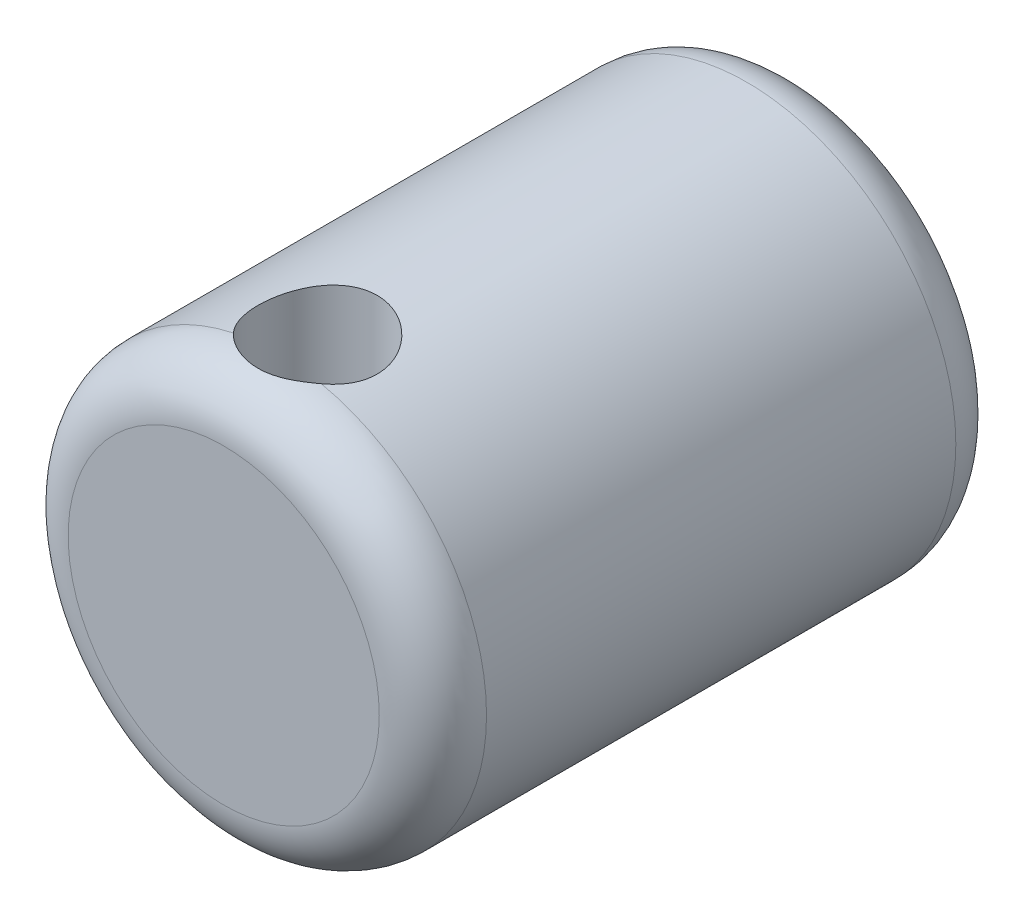
ISO-10303-21;
HEADER;
FILE_DESCRIPTION(('STEP AP214'),'2;1');
FILE_NAME('part.step','',(''),(''),'','','');
FILE_SCHEMA(('AUTOMOTIVE_DESIGN { 1 0 10303 214 1 1 1 1 }'));
ENDSEC;
DATA;
#1=APPLICATION_CONTEXT('core data for automotive mechanical design processes');
#2=APPLICATION_PROTOCOL_DEFINITION('international standard','automotive_design',2000,#1);
#3=PRODUCT_CONTEXT('',#1,'mechanical');
#4=PRODUCT('Part','Part','',(#3));
#5=PRODUCT_RELATED_PRODUCT_CATEGORY('part','',(#4));
#6=PRODUCT_DEFINITION_FORMATION('','',#4);
#7=PRODUCT_DEFINITION_CONTEXT('part definition',#1,'design');
#8=PRODUCT_DEFINITION('design','',#6,#7);
#9=PRODUCT_DEFINITION_SHAPE('','',#8);
#10=(LENGTH_UNIT() NAMED_UNIT(*) SI_UNIT(.MILLI.,.METRE.));
#11=(NAMED_UNIT(*) PLANE_ANGLE_UNIT() SI_UNIT($,.RADIAN.));
#12=(NAMED_UNIT(*) SI_UNIT($,.STERADIAN.) SOLID_ANGLE_UNIT());
#13=UNCERTAINTY_MEASURE_WITH_UNIT(LENGTH_MEASURE(1.E-05),#10,'distance_accuracy_value','');
#14=(GEOMETRIC_REPRESENTATION_CONTEXT(3) GLOBAL_UNCERTAINTY_ASSIGNED_CONTEXT((#13)) GLOBAL_UNIT_ASSIGNED_CONTEXT((#10,
#11,#12)) REPRESENTATION_CONTEXT('',''));
#15=CARTESIAN_POINT('',(0.,0.,0.));
#16=DIRECTION('',(0.,0.,1.));
#17=DIRECTION('',(1.,0.,0.));
#18=AXIS2_PLACEMENT_3D('',#15,#16,#17);
#19=CARTESIAN_POINT('',(0.,0.,-8.89));
#20=DIRECTION('',(0.,0.,1.));
#21=DIRECTION('',(1.,0.,0.));
#22=AXIS2_PLACEMENT_3D('',#19,#20,#21);
#23=CYLINDRICAL_SURFACE('',#22,4.953);
#24=CARTESIAN_POINT('',(0.,0.,-7.62));
#25=DIRECTION('',(0.,0.,1.));
#26=DIRECTION('',(1.,0.,0.));
#27=AXIS2_PLACEMENT_3D('',#24,#25,#26);
#28=CIRCLE('',#27,4.953);
#29=CARTESIAN_POINT('',(4.953,0.,-7.62));
#30=VERTEX_POINT('',#29);
#31=EDGE_CURVE('E74',#30,#30,#28,.T.);
#32=ORIENTED_EDGE('',*,*,#31,.T.);
#33=EDGE_LOOP('',(#32));
#34=FACE_BOUND('',#33,.T.);
#35=CARTESIAN_POINT('',(0.,4.953,1.12888888888889));
#36=CARTESIAN_POINT('',(-0.0775885930600474,4.95299906505589,1.12889027991103));
#37=CARTESIAN_POINT('',(-0.15519151039593,4.9511591936283,1.13530942963889));
#38=CARTESIAN_POINT('',(-0.308148744530289,4.94399880486775,1.16076275463922));
#39=CARTESIAN_POINT('',(-0.383502188746687,4.93867695474055,1.17980176044062));
#40=CARTESIAN_POINT('',(-0.529731464574674,4.92513773804115,1.22981576219991));
#41=CARTESIAN_POINT('',(-0.600613359971401,4.9169243966286,1.26077417109002));
#42=CARTESIAN_POINT('',(-0.736179805780747,4.89846250525702,1.33368317102475));
#43=CARTESIAN_POINT('',(-0.8008637169172,4.88821374569394,1.37563489428524));
#44=CARTESIAN_POINT('',(-0.923889815303389,4.86648069189639,1.47049698514802));
#45=CARTESIAN_POINT('',(-0.982046887053062,4.85497299330631,1.52364206090222));
#46=CARTESIAN_POINT('',(-1.08875533654719,4.83216353681871,1.63888136226149));
#47=CARTESIAN_POINT('',(-1.13730528338975,4.82086180982619,1.70097691858974));
#48=CARTESIAN_POINT('',(-1.22436177969705,4.79950022716315,1.83387929017143));
#49=CARTESIAN_POINT('',(-1.26264846706164,4.78946966943187,1.90483527101752));
#50=CARTESIAN_POINT('',(-1.32667278734697,4.77213330541619,2.0525099670057));
#51=CARTESIAN_POINT('',(-1.35241310265716,4.76482691678843,2.1292274462994));
#52=CARTESIAN_POINT('',(-1.38995793922755,4.75400899563397,2.28418152353182));
#53=CARTESIAN_POINT('',(-1.40210116622748,4.75040542339591,2.36232946370478));
#54=CARTESIAN_POINT('',(-1.41316404957219,4.74712676993972,2.51963004164591));
#55=CARTESIAN_POINT('',(-1.41208656115693,4.74745084047967,2.59878245879142));
#56=CARTESIAN_POINT('',(-1.39700596234428,4.75190890570848,2.75314349415476));
#57=CARTESIAN_POINT('',(-1.38342027979002,4.75591985369119,2.82839702492328));
#58=CARTESIAN_POINT('',(-1.34438062777659,4.76710163221604,2.97550937825752));
#59=CARTESIAN_POINT('',(-1.31892559085754,4.7742727469618,3.04736789485538));
#60=CARTESIAN_POINT('',(-1.25654730165592,4.79106966195446,3.18670255205945));
#61=CARTESIAN_POINT('',(-1.21948360129474,4.80072525061155,3.25411207230086));
#62=CARTESIAN_POINT('',(-1.13503784776128,4.82138806950275,3.38189789512862));
#63=CARTESIAN_POINT('',(-1.08765350900133,4.83239559889905,3.44227263525352));
#64=CARTESIAN_POINT('',(-0.98180980093079,4.85502723154635,3.55665101803811));
#65=CARTESIAN_POINT('',(-0.923002040701852,4.8666589849771,3.61033126045005));
#66=CARTESIAN_POINT('',(-0.797075056679853,4.88886103084431,3.70713897414022));
#67=CARTESIAN_POINT('',(-0.729955407277527,4.89943126887577,3.75026590470062));
#68=CARTESIAN_POINT('',(-0.588762896052575,4.91840037132882,3.8249135434887));
#69=CARTESIAN_POINT('',(-0.514653609426415,4.92678689518358,3.8563686996308));
#70=CARTESIAN_POINT('',(-0.361903721110916,4.94035469963584,3.90627654710075));
#71=CARTESIAN_POINT('',(-0.283264260173515,4.94553678332621,3.9247324964352));
#72=CARTESIAN_POINT('',(-0.126440532934422,4.95198738626627,3.94759397125816));
#73=CARTESIAN_POINT('',(-0.0483251816814675,4.95337811770122,3.95243841960913));
#74=CARTESIAN_POINT('',(0.107604399926596,4.95244451218538,3.94916117038316));
#75=CARTESIAN_POINT('',(0.185418665080456,4.95012061824891,3.9410410189928));
#76=CARTESIAN_POINT('',(0.33692258528249,4.94209843126923,3.91242255962229));
#77=CARTESIAN_POINT('',(0.4106636249542,4.93646861795894,3.89217529068468));
#78=CARTESIAN_POINT('',(0.553690614129379,4.92247944476343,3.84017445503558));
#79=CARTESIAN_POINT('',(0.622976048595792,4.91411977000156,3.80841956092738));
#80=CARTESIAN_POINT('',(0.756782487413098,4.89531979829011,3.73353237875509));
#81=CARTESIAN_POINT('',(0.821168553249705,4.88483852649799,3.69016954035576));
#82=CARTESIAN_POINT('',(0.941902009312916,4.86300319333712,3.59358191210086));
#83=CARTESIAN_POINT('',(0.998247576283992,4.85164893490614,3.54035489172317));
#84=CARTESIAN_POINT('',(1.1031954400924,4.82888702754697,3.42349269479839));
#85=CARTESIAN_POINT('',(1.15148646248705,4.81748964255587,3.35957541137898));
#86=CARTESIAN_POINT('',(1.23667199548381,4.79633036726393,3.22429873605404));
#87=CARTESIAN_POINT('',(1.27356690709098,4.78656841942104,3.15293960612958));
#88=CARTESIAN_POINT('',(1.33464325449896,4.76989932295884,3.00510410049));
#89=CARTESIAN_POINT('',(1.35889243247116,4.76297700618803,2.92865751776168));
#90=CARTESIAN_POINT('',(1.39411618721669,4.75278778548103,2.77253634417422));
#91=CARTESIAN_POINT('',(1.40509475776408,4.74951978180572,2.69286273194972));
#92=CARTESIAN_POINT('',(1.41321295834493,4.74711002986155,2.53576026032293));
#93=CARTESIAN_POINT('',(1.41085652980242,4.74781801747243,2.45835938411562));
#94=CARTESIAN_POINT('',(1.39355871888063,4.75292359256403,2.30510722965311));
#95=CARTESIAN_POINT('',(1.37861775197942,4.75732105823674,2.22925590032434));
#96=CARTESIAN_POINT('',(1.33688543699768,4.76921444005906,2.08199104745025));
#97=CARTESIAN_POINT('',(1.31021508985119,4.77667866888818,2.01054049038486));
#98=CARTESIAN_POINT('',(1.2458746797385,4.79386160284244,1.87307187916816));
#99=CARTESIAN_POINT('',(1.20820267928947,4.80358070500755,1.80705478452205));
#100=CARTESIAN_POINT('',(1.12146107686557,4.82458134910784,1.67995702897613));
#101=CARTESIAN_POINT('',(1.07205447747273,4.83590406369499,1.61911315075819));
#102=CARTESIAN_POINT('',(0.96386866501546,4.85862289512435,1.50641627379429));
#103=CARTESIAN_POINT('',(0.905087099014124,4.8700190297027,1.45456553899282));
#104=CARTESIAN_POINT('',(0.77801555747535,4.89194817868337,1.36001890899291));
#105=CARTESIAN_POINT('',(0.709521596793445,4.90245183006856,1.31758971337451));
#106=CARTESIAN_POINT('',(0.566073546488071,4.92107569573418,1.24491245951963));
#107=CARTESIAN_POINT('',(0.491123042391253,4.92919722198694,1.21465769270207));
#108=CARTESIAN_POINT('',(0.34720201834831,4.94127142551116,1.17048356039092));
#109=CARTESIAN_POINT('',(0.278765077144419,4.94563534566828,1.15492491582538));
#110=CARTESIAN_POINT('',(0.140222508980719,4.95149986626767,1.13412763310066));
#111=CARTESIAN_POINT('',(0.070117103668698,4.95300084491251,1.12888763181694));
#112=CARTESIAN_POINT('',(0.,4.953,1.12888888888889));
#113=B_SPLINE_CURVE_WITH_KNOTS('',3,(#35,#36,#37,#38,#39,#40,#41,#42,#43,#44,#45,#46,#47,#48,
#49,#50,#51,#52,#53,#54,#55,#56,#57,#58,#59,#60,#61,#62,#63,#64,#65,#66,#67,#68,#69,#70,#71,#72,
#73,#74,#75,#76,#77,#78,#79,#80,#81,#82,#83,#84,#85,#86,#87,#88,#89,#90,#91,#92,#93,#94,#95,#96,
#97,#98,#99,#100,#101,#102,#103,#104,#105,#106,#107,#108,#109,#110,#111,#112),.UNSPECIFIED.,.T.,
.F.,(4,2,2,2,2,2,2,2,2,2,2,2,2,2,2,2,2,2,2,2,2,2,2,2,2,2,2,2,2,2,2,2,2,2,2,2,2,2,4),(0.,
0.232508420439531,0.465105890050664,0.697380839655164,0.929679720969844,1.16744661902199,
1.40524890387857,1.64779878439725,1.89029678546198,2.12660953848822,2.36287125662615,
2.59152342694713,2.82019616486583,3.05174996398897,3.28335509478129,3.5236365361368,
3.76393028616531,4.005553871168,4.24711687619557,4.48079565145541,4.71444655975383,
4.94342025899023,5.17242037859805,5.40635807172676,5.64034872832408,5.88194619747596,
6.12353516435479,6.36381630875039,6.60402512279387,6.83521835903041,7.06640396273003,
7.2952586258833,7.5241536165788,7.76065102498224,7.99720788337997,8.23978762210709,
8.48223350636485,8.69238000417044,8.90249873911369),.UNSPECIFIED.);
#114=CARTESIAN_POINT('',(1.04114279419359,4.84233731601783,3.4925));
#115=VERTEX_POINT('',#114);
#116=CARTESIAN_POINT('',(-1.04114279419359,4.84233731601783,3.4925));
#117=VERTEX_POINT('',#116);
#118=EDGE_CURVE('E73',#115,#117,#113,.T.);
#119=ORIENTED_EDGE('',*,*,#118,.F.);
#120=CARTESIAN_POINT('',(0.,0.,3.4925));
#121=DIRECTION('',(0.,0.,1.));
#122=DIRECTION('',(1.,0.,0.));
#123=AXIS2_PLACEMENT_3D('',#120,#121,#122);
#124=CIRCLE('',#123,4.953);
#125=CARTESIAN_POINT('',(1.04114279419359,-4.84233731601783,3.4925));
#126=VERTEX_POINT('',#125);
#127=EDGE_CURVE('E69',#115,#126,#124,.F.);
#128=ORIENTED_EDGE('',*,*,#127,.T.);
#129=CARTESIAN_POINT('',(0.,-4.953,3.95111111111111));
#130=CARTESIAN_POINT('',(0.0775885930600474,-4.95299906505589,3.95110972008897));
#131=CARTESIAN_POINT('',(0.15519151039593,-4.9511591936283,3.94469057036112));
#132=CARTESIAN_POINT('',(0.308148744530289,-4.94399880486775,3.91923724536078));
#133=CARTESIAN_POINT('',(0.383502188746687,-4.93867695474055,3.90019823955938));
#134=CARTESIAN_POINT('',(0.529731464574674,-4.92513773804115,3.85018423780009));
#135=CARTESIAN_POINT('',(0.600613359971401,-4.9169243966286,3.81922582890998));
#136=CARTESIAN_POINT('',(0.736179805780748,-4.89846250525702,3.74631682897525));
#137=CARTESIAN_POINT('',(0.8008637169172,-4.88821374569394,3.70436510571476));
#138=CARTESIAN_POINT('',(0.923889815303389,-4.86648069189639,3.60950301485198));
#139=CARTESIAN_POINT('',(0.982046887053062,-4.85497299330631,3.55635793909778));
#140=CARTESIAN_POINT('',(1.08875533654719,-4.83216353681871,3.44111863773851));
#141=CARTESIAN_POINT('',(1.13730528338975,-4.82086180982619,3.37902308141026));
#142=CARTESIAN_POINT('',(1.22436177969705,-4.79950022716315,3.24612070982857));
#143=CARTESIAN_POINT('',(1.26264846706164,-4.78946966943187,3.17516472898248));
#144=CARTESIAN_POINT('',(1.32667278734697,-4.77213330541619,3.0274900329943));
#145=CARTESIAN_POINT('',(1.35241310265716,-4.76482691678843,2.95077255370061));
#146=CARTESIAN_POINT('',(1.38995793922755,-4.75400899563397,2.79581847646818));
#147=CARTESIAN_POINT('',(1.40210116622748,-4.75040542339591,2.71767053629522));
#148=CARTESIAN_POINT('',(1.41316404957219,-4.74712676993972,2.56036995835409));
#149=CARTESIAN_POINT('',(1.41208656115693,-4.74745084047967,2.48121754120858));
#150=CARTESIAN_POINT('',(1.39700596234428,-4.75190890570848,2.32685650584524));
#151=CARTESIAN_POINT('',(1.38342027979002,-4.75591985369119,2.25160297507672));
#152=CARTESIAN_POINT('',(1.34438062777659,-4.76710163221604,2.10449062174248));
#153=CARTESIAN_POINT('',(1.31892559085754,-4.7742727469618,2.03263210514463));
#154=CARTESIAN_POINT('',(1.25654730165592,-4.79106966195446,1.89329744794055));
#155=CARTESIAN_POINT('',(1.21948360129474,-4.80072525061155,1.82588792769914));
#156=CARTESIAN_POINT('',(1.13503784776128,-4.82138806950275,1.69810210487138));
#157=CARTESIAN_POINT('',(1.08765350900133,-4.83239559889905,1.63772736474648));
#158=CARTESIAN_POINT('',(0.98180980093079,-4.85502723154635,1.52334898196189));
#159=CARTESIAN_POINT('',(0.923002040701852,-4.8666589849771,1.46966873954995));
#160=CARTESIAN_POINT('',(0.797075056679853,-4.88886103084431,1.37286102585978));
#161=CARTESIAN_POINT('',(0.729955407277527,-4.89943126887577,1.32973409529938));
#162=CARTESIAN_POINT('',(0.588762896052575,-4.91840037132882,1.2550864565113));
#163=CARTESIAN_POINT('',(0.514653609426415,-4.92678689518358,1.2236313003692));
#164=CARTESIAN_POINT('',(0.361903721110915,-4.94035469963584,1.17372345289925));
#165=CARTESIAN_POINT('',(0.283264260173514,-4.94553678332621,1.1552675035648));
#166=CARTESIAN_POINT('',(0.126440532934421,-4.95198738626627,1.13240602874184));
#167=CARTESIAN_POINT('',(0.0483251816814667,-4.95337811770122,1.12756158039087));
#168=CARTESIAN_POINT('',(-0.107604399926597,-4.95244451218538,1.13083882961684));
#169=CARTESIAN_POINT('',(-0.185418665080456,-4.95012061824891,1.1389589810072));
#170=CARTESIAN_POINT('',(-0.33692258528249,-4.94209843126923,1.16757744037771));
#171=CARTESIAN_POINT('',(-0.4106636249542,-4.93646861795894,1.18782470931533));
#172=CARTESIAN_POINT('',(-0.553690614129379,-4.92247944476343,1.23982554496442));
#173=CARTESIAN_POINT('',(-0.622976048595793,-4.91411977000156,1.27158043907262));
#174=CARTESIAN_POINT('',(-0.756782487413098,-4.89531979829011,1.34646762124491));
#175=CARTESIAN_POINT('',(-0.821168553249706,-4.88483852649799,1.38983045964424));
#176=CARTESIAN_POINT('',(-0.941902009312917,-4.86300319333712,1.48641808789914));
#177=CARTESIAN_POINT('',(-0.998247576283993,-4.85164893490614,1.53964510827683));
#178=CARTESIAN_POINT('',(-1.1031954400924,-4.82888702754697,1.65650730520161));
#179=CARTESIAN_POINT('',(-1.15148646248705,-4.81748964255587,1.72042458862102));
#180=CARTESIAN_POINT('',(-1.23667199548381,-4.79633036726393,1.85570126394596));
#181=CARTESIAN_POINT('',(-1.27356690709098,-4.78656841942104,1.92706039387042));
#182=CARTESIAN_POINT('',(-1.33464325449896,-4.76989932295884,2.07489589951));
#183=CARTESIAN_POINT('',(-1.35889243247116,-4.76297700618803,2.15134248223833));
#184=CARTESIAN_POINT('',(-1.39411618721669,-4.75278778548103,2.30746365582578));
#185=CARTESIAN_POINT('',(-1.40509475776408,-4.74951978180572,2.38713726805028));
#186=CARTESIAN_POINT('',(-1.41321295834493,-4.74711002986155,2.54423973967708));
#187=CARTESIAN_POINT('',(-1.41085652980242,-4.74781801747243,2.62164061588438));
#188=CARTESIAN_POINT('',(-1.39355871888063,-4.75292359256403,2.7748927703469));
#189=CARTESIAN_POINT('',(-1.37861775197942,-4.75732105823674,2.85074409967566));
#190=CARTESIAN_POINT('',(-1.33688543699768,-4.76921444005906,2.99800895254975));
#191=CARTESIAN_POINT('',(-1.31021508985119,-4.77667866888818,3.06945950961514));
#192=CARTESIAN_POINT('',(-1.24587467973849,-4.79386160284244,3.20692812083184));
#193=CARTESIAN_POINT('',(-1.20820267928947,-4.80358070500755,3.27294521547795));
#194=CARTESIAN_POINT('',(-1.12146107686557,-4.82458134910784,3.40004297102387));
#195=CARTESIAN_POINT('',(-1.07205447747273,-4.83590406369499,3.46088684924181));
#196=CARTESIAN_POINT('',(-0.963868665015459,-4.85862289512435,3.57358372620571));
#197=CARTESIAN_POINT('',(-0.905087099014124,-4.8700190297027,3.62543446100718));
#198=CARTESIAN_POINT('',(-0.77801555747535,-4.89194817868337,3.71998109100709));
#199=CARTESIAN_POINT('',(-0.709521596793445,-4.90245183006856,3.76241028662549));
#200=CARTESIAN_POINT('',(-0.566073546488072,-4.92107569573418,3.83508754048037));
#201=CARTESIAN_POINT('',(-0.491123042391254,-4.92919722198694,3.86534230729793));
#202=CARTESIAN_POINT('',(-0.34720201834831,-4.94127142551116,3.90951643960908));
#203=CARTESIAN_POINT('',(-0.278765077144418,-4.94563534566828,3.92507508417463));
#204=CARTESIAN_POINT('',(-0.140222508980718,-4.95149986626767,3.94587236689934));
#205=CARTESIAN_POINT('',(-0.0701171036686975,-4.95300084491251,3.95111236818306));
#206=CARTESIAN_POINT('',(0.,-4.953,3.95111111111111));
#207=B_SPLINE_CURVE_WITH_KNOTS('',3,(#129,#130,#131,#132,#133,#134,#135,#136,#137,#138,#139,
#140,#141,#142,#143,#144,#145,#146,#147,#148,#149,#150,#151,#152,#153,#154,#155,#156,#157,#158,
#159,#160,#161,#162,#163,#164,#165,#166,#167,#168,#169,#170,#171,#172,#173,#174,#175,#176,#177,
#178,#179,#180,#181,#182,#183,#184,#185,#186,#187,#188,#189,#190,#191,#192,#193,#194,#195,#196,
#197,#198,#199,#200,#201,#202,#203,#204,#205,#206),.UNSPECIFIED.,.T.,.F.,(4,2,2,2,2,2,2,2,2,2,2,
2,2,2,2,2,2,2,2,2,2,2,2,2,2,2,2,2,2,2,2,2,2,2,2,2,2,2,4),(0.,0.23250842043953,0.465105890050664,
0.697380839655164,0.929679720969845,1.16744661902199,1.40524890387857,1.64779878439725,
1.89029678546198,2.12660953848823,2.36287125662615,2.59152342694713,2.82019616486583,
3.05174996398897,3.28335509478129,3.5236365361368,3.76393028616531,4.005553871168,
4.24711687619557,4.48079565145542,4.71444655975383,4.94342025899023,5.17242037859805,
5.40635807172676,5.64034872832408,5.88194619747596,6.12353516435479,6.36381630875039,
6.60402512279387,6.83521835903042,7.06640396273003,7.29525862588331,7.5241536165788,
7.76065102498224,7.99720788337997,8.23978762210709,8.48223350636484,8.69238000417044,
8.90249873911369),.UNSPECIFIED.);
#208=CARTESIAN_POINT('',(-1.04114279419359,-4.84233731601783,3.4925));
#209=VERTEX_POINT('',#208);
#210=EDGE_CURVE('E72',#126,#209,#207,.T.);
#211=ORIENTED_EDGE('',*,*,#210,.T.);
#212=CARTESIAN_POINT('',(0.,0.,3.4925));
#213=DIRECTION('',(0.,0.,1.));
#214=DIRECTION('',(1.,0.,0.));
#215=AXIS2_PLACEMENT_3D('',#212,#213,#214);
#216=CIRCLE('',#215,4.953);
#217=EDGE_CURVE('E60',#209,#117,#216,.F.);
#218=ORIENTED_EDGE('',*,*,#217,.T.);
#219=EDGE_LOOP('',(#119,#128,#211,#218));
#220=FACE_BOUND('',#219,.T.);
#221=ADVANCED_FACE('F35',(#34,#220),#23,.T.);
#222=CARTESIAN_POINT('',(0.,0.,-8.89));
#223=DIRECTION('',(0.,0.,1.));
#224=DIRECTION('',(1.,0.,0.));
#225=AXIS2_PLACEMENT_3D('',#222,#223,#224);
#226=PLANE('',#225);
#227=CARTESIAN_POINT('',(0.,0.,-8.89));
#228=DIRECTION('',(0.,0.,1.));
#229=DIRECTION('',(1.,0.,0.));
#230=AXIS2_PLACEMENT_3D('',#227,#228,#229);
#231=CIRCLE('',#230,3.683);
#232=CARTESIAN_POINT('',(3.683,0.,-8.89));
#233=VERTEX_POINT('',#232);
#234=EDGE_CURVE('E106',#233,#233,#231,.F.);
#235=ORIENTED_EDGE('',*,*,#234,.T.);
#236=EDGE_LOOP('',(#235));
#237=FACE_BOUND('',#236,.T.);
#238=CARTESIAN_POINT('',(0.,0.,-8.89));
#239=DIRECTION('',(0.,0.,1.));
#240=DIRECTION('',(1.,0.,0.));
#241=AXIS2_PLACEMENT_3D('',#238,#239,#240);
#242=CIRCLE('',#241,2.413);
#243=CARTESIAN_POINT('',(2.413,0.,-8.89));
#244=VERTEX_POINT('',#243);
#245=EDGE_CURVE('E112',#244,#244,#242,.T.);
#246=ORIENTED_EDGE('',*,*,#245,.T.);
#247=EDGE_LOOP('',(#246));
#248=FACE_BOUND('',#247,.T.);
#249=ADVANCED_FACE('F121',(#237,#248),#226,.F.);
#250=CARTESIAN_POINT('',(0.,0.,-8.89));
#251=DIRECTION('',(0.,0.,1.));
#252=DIRECTION('',(1.,0.,0.));
#253=AXIS2_PLACEMENT_3D('',#250,#251,#252);
#254=CYLINDRICAL_SURFACE('',#253,2.413);
#255=ORIENTED_EDGE('',*,*,#245,.F.);
#256=EDGE_LOOP('',(#255));
#257=FACE_BOUND('',#256,.T.);
#258=CARTESIAN_POINT('',(0.,0.,0.));
#259=DIRECTION('',(0.,0.,1.));
#260=DIRECTION('',(1.,0.,0.));
#261=AXIS2_PLACEMENT_3D('',#258,#259,#260);
#262=CIRCLE('',#261,2.413);
#263=CARTESIAN_POINT('',(2.413,0.,0.));
#264=VERTEX_POINT('',#263);
#265=EDGE_CURVE('E78',#264,#264,#262,.F.);
#266=ORIENTED_EDGE('',*,*,#265,.F.);
#267=EDGE_LOOP('',(#266));
#268=FACE_BOUND('',#267,.T.);
#269=ADVANCED_FACE('F119',(#257,#268),#254,.F.);
#270=CARTESIAN_POINT('',(0.,0.,0.));
#271=DIRECTION('',(0.,0.,1.));
#272=DIRECTION('',(1.,0.,0.));
#273=AXIS2_PLACEMENT_3D('',#270,#271,#272);
#274=PLANE('',#273);
#275=ORIENTED_EDGE('',*,*,#265,.T.);
#276=EDGE_LOOP('',(#275));
#277=FACE_BOUND('',#276,.T.);
#278=ADVANCED_FACE('F117',(#277),#274,.F.);
#279=CARTESIAN_POINT('',(0.,0.,4.7625));
#280=DIRECTION('',(0.,0.,1.));
#281=DIRECTION('',(1.,0.,0.));
#282=AXIS2_PLACEMENT_3D('',#279,#280,#281);
#283=PLANE('',#282);
#284=CARTESIAN_POINT('',(0.,0.,4.7625));
#285=DIRECTION('',(0.,0.,1.));
#286=DIRECTION('',(1.,0.,0.));
#287=AXIS2_PLACEMENT_3D('',#284,#285,#286);
#288=CIRCLE('',#287,3.683);
#289=CARTESIAN_POINT('',(3.683,0.,4.7625));
#290=VERTEX_POINT('',#289);
#291=EDGE_CURVE('E103',#290,#290,#288,.T.);
#292=ORIENTED_EDGE('',*,*,#291,.T.);
#293=EDGE_LOOP('',(#292));
#294=FACE_BOUND('',#293,.T.);
#295=ADVANCED_FACE('F95',(#294),#283,.T.);
#296=CARTESIAN_POINT('',(0.,4.954,2.54));
#297=DIRECTION('',(0.,-1.,0.));
#298=DIRECTION('',(0.,0.,-1.));
#299=AXIS2_PLACEMENT_3D('',#296,#297,#298);
#300=CYLINDRICAL_SURFACE('',#299,1.41111111111111);
#301=ORIENTED_EDGE('',*,*,#118,.T.);
#302=CARTESIAN_POINT('',(-1.04114279419359,4.84233731601783,3.4925));
#303=CARTESIAN_POINT('',(-1.01589154773765,4.84776816320068,3.52010667090682));
#304=CARTESIAN_POINT('',(-0.989468316178916,4.85232022453466,3.54677766513667));
#305=CARTESIAN_POINT('',(-0.934481163981943,4.85991964312026,3.59801207512861));
#306=CARTESIAN_POINT('',(-0.905918613507548,4.86296795414189,3.62257681861244));
#307=CARTESIAN_POINT('',(-0.817508985956176,4.87022538344799,3.69262420644748));
#308=CARTESIAN_POINT('',(-0.754737979562546,4.87258572274624,3.73468090306234));
#309=CARTESIAN_POINT('',(-0.62342423134379,4.87444999073686,3.80816443639632));
#310=CARTESIAN_POINT('',(-0.554890962461746,4.87395852059177,3.83960830933826));
#311=CARTESIAN_POINT('',(-0.413664951277516,4.87206761428324,3.89121000062178));
#312=CARTESIAN_POINT('',(-0.340969765263812,4.87066763959211,3.91136111182328));
#313=CARTESIAN_POINT('',(-0.18959776171454,4.86837538571817,3.94054261947035));
#314=CARTESIAN_POINT('',(-0.110803355367613,4.86751186663089,3.94896913004823));
#315=CARTESIAN_POINT('',(0.047091772592853,4.86716594113374,3.95253385697013));
#316=CARTESIAN_POINT('',(0.126192504767856,4.8676835827744,3.94767161099866));
#317=CARTESIAN_POINT('',(0.282563105881321,4.86965823100005,3.92479274003478));
#318=CARTESIAN_POINT('',(0.35983003189315,4.871116653924,3.90675627593244));
#319=CARTESIAN_POINT('',(0.510285066362268,4.87346776146209,3.85798542365246));
#320=CARTESIAN_POINT('',(0.583474287653275,4.87436060112439,3.8272545193299));
#321=CARTESIAN_POINT('',(0.689859808071206,4.87363953409452,3.77167213051967));
#322=CARTESIAN_POINT('',(0.725359343122865,4.87302481648541,3.75110275554731));
#323=CARTESIAN_POINT('',(0.794416728494534,4.87072116222749,3.70696767325082));
#324=CARTESIAN_POINT('',(0.827974837154222,4.86903236886301,3.68340236592683));
#325=CARTESIAN_POINT('',(0.89296602326405,4.86423293634021,3.63340357899959));
#326=CARTESIAN_POINT('',(0.924391160004776,4.86111728646588,3.6069602441649));
#327=CARTESIAN_POINT('',(0.984729590873452,4.85312906037184,3.5515479331933));
#328=CARTESIAN_POINT('',(1.01364093258535,4.84825513339518,3.52257702831572));
#329=CARTESIAN_POINT('',(1.04114279419359,4.84233731601783,3.4925));
#330=B_SPLINE_CURVE_WITH_KNOTS('',3,(#302,#303,#304,#305,#306,#307,#308,#309,#310,#311,#312,
#313,#314,#315,#316,#317,#318,#319,#320,#321,#322,#323,#324,#325,#326,#327,#328,#329),
.UNSPECIFIED.,.F.,.F.,(4,2,2,2,2,2,2,2,2,2,2,2,2,4),(0.,0.113328937220346,0.226585901612259,
0.45220690590581,0.677463990386245,0.902854720998668,1.13947160474644,1.37609672049411,
1.61307890757007,1.84999610055008,1.9729543461139,2.09589619218706,2.21927312553652,
2.34274504299447),.UNSPECIFIED.);
#331=EDGE_CURVE('E48',#117,#115,#330,.T.);
#332=ORIENTED_EDGE('',*,*,#331,.T.);
#333=EDGE_LOOP('',(#301,#332));
#334=FACE_BOUND('',#333,.T.);
#335=ORIENTED_EDGE('',*,*,#210,.F.);
#336=CARTESIAN_POINT('',(1.04114279419359,-4.84233731601783,3.4925));
#337=CARTESIAN_POINT('',(1.01589154773765,-4.84776816320068,3.52010667090682));
#338=CARTESIAN_POINT('',(0.989468316178916,-4.85232022453466,3.54677766513667));
#339=CARTESIAN_POINT('',(0.934481163981943,-4.85991964312026,3.59801207512861));
#340=CARTESIAN_POINT('',(0.905918613507548,-4.86296795414189,3.62257681861244));
#341=CARTESIAN_POINT('',(0.817508985956176,-4.87022538344799,3.69262420644748));
#342=CARTESIAN_POINT('',(0.754737979562546,-4.87258572274624,3.73468090306234));
#343=CARTESIAN_POINT('',(0.62342423134379,-4.87444999073686,3.80816443639632));
#344=CARTESIAN_POINT('',(0.554890962461746,-4.87395852059177,3.83960830933826));
#345=CARTESIAN_POINT('',(0.413664951277516,-4.87206761428324,3.89121000062178));
#346=CARTESIAN_POINT('',(0.340969765263812,-4.87066763959211,3.91136111182328));
#347=CARTESIAN_POINT('',(0.18959776171454,-4.86837538571817,3.94054261947035));
#348=CARTESIAN_POINT('',(0.110803355367613,-4.86751186663089,3.94896913004823));
#349=CARTESIAN_POINT('',(-0.047091772592853,-4.86716594113374,3.95253385697013));
#350=CARTESIAN_POINT('',(-0.126192504767856,-4.8676835827744,3.94767161099866));
#351=CARTESIAN_POINT('',(-0.282563105881321,-4.86965823100005,3.92479274003478));
#352=CARTESIAN_POINT('',(-0.35983003189315,-4.871116653924,3.90675627593244));
#353=CARTESIAN_POINT('',(-0.510285066362268,-4.87346776146209,3.85798542365246));
#354=CARTESIAN_POINT('',(-0.583474287653275,-4.87436060112439,3.8272545193299));
#355=CARTESIAN_POINT('',(-0.689859808071206,-4.87363953409452,3.77167213051967));
#356=CARTESIAN_POINT('',(-0.725359343122865,-4.87302481648541,3.75110275554731));
#357=CARTESIAN_POINT('',(-0.794416728494534,-4.87072116222749,3.70696767325082));
#358=CARTESIAN_POINT('',(-0.827974837154222,-4.86903236886301,3.68340236592683));
#359=CARTESIAN_POINT('',(-0.89296602326405,-4.86423293634021,3.63340357899959));
#360=CARTESIAN_POINT('',(-0.924391160004776,-4.86111728646588,3.6069602441649));
#361=CARTESIAN_POINT('',(-0.984729590873452,-4.85312906037184,3.5515479331933));
#362=CARTESIAN_POINT('',(-1.01364093258535,-4.84825513339518,3.52257702831572));
#363=CARTESIAN_POINT('',(-1.04114279419359,-4.84233731601783,3.4925));
#364=B_SPLINE_CURVE_WITH_KNOTS('',3,(#336,#337,#338,#339,#340,#341,#342,#343,#344,#345,#346,
#347,#348,#349,#350,#351,#352,#353,#354,#355,#356,#357,#358,#359,#360,#361,#362,#363),
.UNSPECIFIED.,.F.,.F.,(4,2,2,2,2,2,2,2,2,2,2,2,2,4),(0.,0.113328937220346,0.226585901612259,
0.45220690590581,0.677463990386245,0.902854720998668,1.13947160474644,1.37609672049411,
1.61307890757007,1.84999610055008,1.9729543461139,2.09589619218706,2.21927312553652,
2.34274504299447),.UNSPECIFIED.);
#365=EDGE_CURVE('E11',#126,#209,#364,.T.);
#366=ORIENTED_EDGE('',*,*,#365,.T.);
#367=EDGE_LOOP('',(#335,#366));
#368=FACE_BOUND('',#367,.T.);
#369=ADVANCED_FACE('F76',(#334,#368),#300,.F.);
#370=CARTESIAN_POINT('',(0.,0.,-7.62));
#371=DIRECTION('',(0.,0.,1.));
#372=DIRECTION('',(1.,0.,0.));
#373=AXIS2_PLACEMENT_3D('',#370,#371,#372);
#374=TOROIDAL_SURFACE('',#373,3.683,1.27);
#375=ORIENTED_EDGE('',*,*,#234,.F.);
#376=EDGE_LOOP('',(#375));
#377=FACE_BOUND('',#376,.T.);
#378=ORIENTED_EDGE('',*,*,#31,.F.);
#379=EDGE_LOOP('',(#378));
#380=FACE_BOUND('',#379,.T.);
#381=ADVANCED_FACE('F94',(#377,#380),#374,.T.);
#382=CARTESIAN_POINT('',(0.,0.,3.4925));
#383=DIRECTION('',(0.,0.,1.));
#384=DIRECTION('',(1.,0.,0.));
#385=AXIS2_PLACEMENT_3D('',#382,#383,#384);
#386=TOROIDAL_SURFACE('',#385,3.683,1.27);
#387=ORIENTED_EDGE('',*,*,#365,.F.);
#388=ORIENTED_EDGE('',*,*,#127,.F.);
#389=ORIENTED_EDGE('',*,*,#331,.F.);
#390=ORIENTED_EDGE('',*,*,#217,.F.);
#391=EDGE_LOOP('',(#387,#388,#389,#390));
#392=FACE_BOUND('',#391,.T.);
#393=ORIENTED_EDGE('',*,*,#291,.F.);
#394=EDGE_LOOP('',(#393));
#395=FACE_BOUND('',#394,.T.);
#396=ADVANCED_FACE('F37',(#392,#395),#386,.T.);
#397=CLOSED_SHELL('',(#221,#249,#269,#278,#295,#369,#381,#396));
#398=MANIFOLD_SOLID_BREP('B2',#397);
#399=ADVANCED_BREP_SHAPE_REPRESENTATION('',(#18,#398),#14);
#400=SHAPE_DEFINITION_REPRESENTATION(#9,#399);
ENDSEC;
END-ISO-10303-21;
